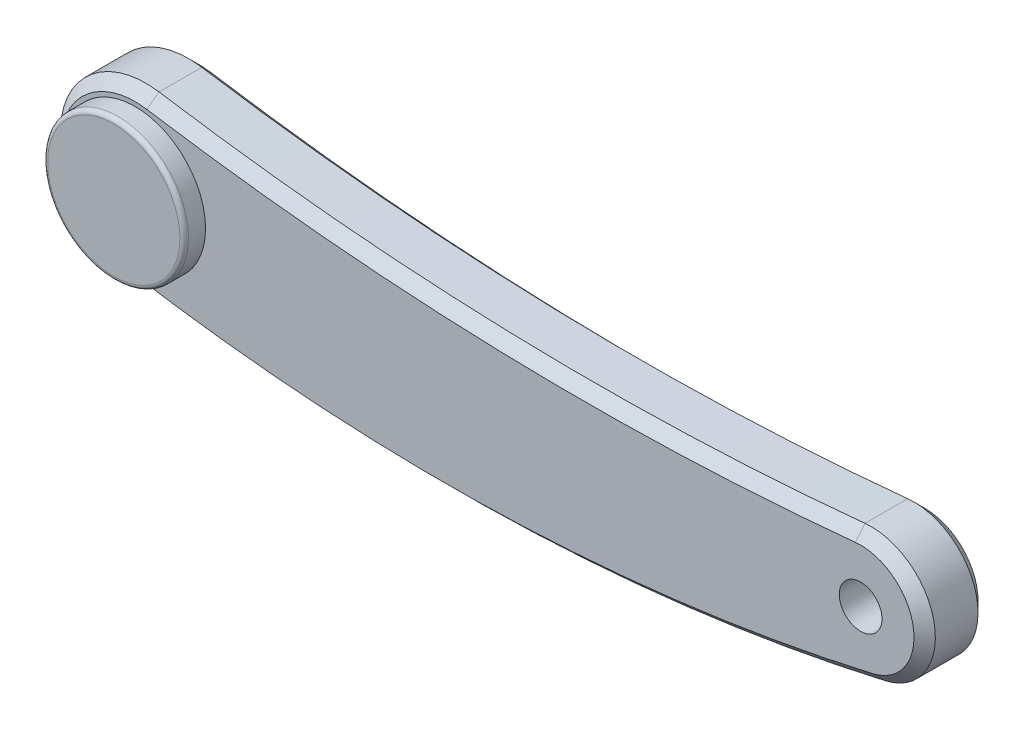
ISO-10303-21;
HEADER;
FILE_DESCRIPTION(('STEP AP214'),'2;1');
FILE_NAME('part.step','',(''),(''),'','','');
FILE_SCHEMA(('AUTOMOTIVE_DESIGN { 1 0 10303 214 1 1 1 1 }'));
ENDSEC;
DATA;
#1=APPLICATION_CONTEXT('core data for automotive mechanical design processes');
#2=APPLICATION_PROTOCOL_DEFINITION('international standard','automotive_design',2000,#1);
#3=PRODUCT_CONTEXT('',#1,'mechanical');
#4=PRODUCT('Part','Part','',(#3));
#5=PRODUCT_RELATED_PRODUCT_CATEGORY('part','',(#4));
#6=PRODUCT_DEFINITION_FORMATION('','',#4);
#7=PRODUCT_DEFINITION_CONTEXT('part definition',#1,'design');
#8=PRODUCT_DEFINITION('design','',#6,#7);
#9=PRODUCT_DEFINITION_SHAPE('','',#8);
#10=(LENGTH_UNIT() NAMED_UNIT(*) SI_UNIT(.MILLI.,.METRE.));
#11=(NAMED_UNIT(*) PLANE_ANGLE_UNIT() SI_UNIT($,.RADIAN.));
#12=(NAMED_UNIT(*) SI_UNIT($,.STERADIAN.) SOLID_ANGLE_UNIT());
#13=UNCERTAINTY_MEASURE_WITH_UNIT(LENGTH_MEASURE(1.E-05),#10,'distance_accuracy_value','');
#14=(GEOMETRIC_REPRESENTATION_CONTEXT(3) GLOBAL_UNCERTAINTY_ASSIGNED_CONTEXT((#13)) GLOBAL_UNIT_ASSIGNED_CONTEXT((#10,
#11,#12)) REPRESENTATION_CONTEXT('',''));
#15=CARTESIAN_POINT('',(0.,0.,0.));
#16=DIRECTION('',(0.,0.,1.));
#17=DIRECTION('',(1.,0.,0.));
#18=AXIS2_PLACEMENT_3D('',#15,#16,#17);
#19=CARTESIAN_POINT('',(-12.7205882352943,423.881689431082,7.5));
#20=DIRECTION('',(0.,0.,-1.));
#21=DIRECTION('',(-1.,0.,0.));
#22=AXIS2_PLACEMENT_3D('',#19,#20,#21);
#23=CYLINDRICAL_SURFACE('',#22,450.);
#24=DIRECTION('',(0.,0.,-1.));
#25=VECTOR('',#24,1.);
#26=CARTESIAN_POINT('',(-88.3618331053352,-19.7154274153992,7.5));
#27=LINE('',#26,#25);
#28=CARTESIAN_POINT('',(-88.3618331053352,-19.7154274153992,5.));
#29=VERTEX_POINT('',#28);
#30=CARTESIAN_POINT('',(-88.3618331053352,-19.7154274153992,-4.99999999999989));
#31=VERTEX_POINT('',#30);
#32=EDGE_CURVE('E365',#29,#31,#27,.T.);
#33=ORIENTED_EDGE('',*,*,#32,.T.);
#34=CARTESIAN_POINT('',(-12.7205882352943,423.881689431082,-4.99999999999989));
#35=DIRECTION('',(0.,0.,1.));
#36=DIRECTION('',(1.,0.,0.));
#37=AXIS2_PLACEMENT_3D('',#34,#35,#36);
#38=CIRCLE('',#37,450.);
#39=CARTESIAN_POINT('',(88.3696754563895,-14.6166099803821,-4.99999999999989));
#40=VERTEX_POINT('',#39);
#41=EDGE_CURVE('E398',#31,#40,#38,.T.);
#42=ORIENTED_EDGE('',*,*,#41,.T.);
#43=DIRECTION('',(0.,0.,-1.));
#44=VECTOR('',#43,1.);
#45=CARTESIAN_POINT('',(88.3696754563895,-14.6166099803821,7.5));
#46=LINE('',#45,#44);
#47=CARTESIAN_POINT('',(88.3696754563895,-14.6166099803821,5.));
#48=VERTEX_POINT('',#47);
#49=EDGE_CURVE('E139',#48,#40,#46,.T.);
#50=ORIENTED_EDGE('',*,*,#49,.F.);
#51=CARTESIAN_POINT('',(-12.7205882352943,423.881689431082,5.));
#52=DIRECTION('',(0.,0.,1.));
#53=DIRECTION('',(1.,0.,0.));
#54=AXIS2_PLACEMENT_3D('',#51,#52,#53);
#55=CIRCLE('',#54,450.);
#56=EDGE_CURVE('E395',#48,#29,#55,.F.);
#57=ORIENTED_EDGE('',*,*,#56,.T.);
#58=EDGE_LOOP('',(#33,#42,#50,#57));
#59=FACE_BOUND('',#58,.T.);
#60=ADVANCED_FACE('F49',(#59),#23,.T.);
#61=CARTESIAN_POINT('',(85.,0.,7.5));
#62=DIRECTION('',(0.,0.,-1.));
#63=DIRECTION('',(-1.,0.,0.));
#64=AXIS2_PLACEMENT_3D('',#61,#62,#63);
#65=CYLINDRICAL_SURFACE('',#64,15.);
#66=ORIENTED_EDGE('',*,*,#49,.T.);
#67=CARTESIAN_POINT('',(85.,0.,-4.99999999999989));
#68=DIRECTION('',(0.,0.,1.));
#69=DIRECTION('',(1.,0.,0.));
#70=AXIS2_PLACEMENT_3D('',#67,#68,#69);
#71=CIRCLE('',#70,15.);
#72=CARTESIAN_POINT('',(83.5255417956656,14.9273565310028,-4.99999999999989));
#73=VERTEX_POINT('',#72);
#74=EDGE_CURVE('E137',#40,#73,#71,.T.);
#75=ORIENTED_EDGE('',*,*,#74,.T.);
#76=DIRECTION('',(0.,0.,-1.));
#77=VECTOR('',#76,1.);
#78=CARTESIAN_POINT('',(83.5255417956656,14.9273565310028,7.5));
#79=LINE('',#78,#77);
#80=CARTESIAN_POINT('',(83.5255417956656,14.9273565310028,5.));
#81=VERTEX_POINT('',#80);
#82=EDGE_CURVE('E119',#81,#73,#79,.T.);
#83=ORIENTED_EDGE('',*,*,#82,.F.);
#84=CARTESIAN_POINT('',(85.,0.,5.));
#85=DIRECTION('',(0.,0.,1.));
#86=DIRECTION('',(1.,0.,0.));
#87=AXIS2_PLACEMENT_3D('',#84,#85,#86);
#88=CIRCLE('',#87,15.);
#89=EDGE_CURVE('E134',#81,#48,#88,.F.);
#90=ORIENTED_EDGE('',*,*,#89,.T.);
#91=EDGE_LOOP('',(#66,#75,#83,#90));
#92=FACE_BOUND('',#91,.T.);
#93=ADVANCED_FACE('F133',(#92),#65,.T.);
#94=CARTESIAN_POINT('',(19.6323529411765,661.779472874456,7.5));
#95=DIRECTION('',(0.,0.,-1.));
#96=DIRECTION('',(-1.,0.,0.));
#97=AXIS2_PLACEMENT_3D('',#94,#95,#96);
#98=CYLINDRICAL_SURFACE('',#97,650.);
#99=ORIENTED_EDGE('',*,*,#82,.T.);
#100=CARTESIAN_POINT('',(19.6323529411765,661.779472874456,-4.99999999999989));
#101=DIRECTION('',(0.,0.,1.));
#102=DIRECTION('',(1.,0.,0.));
#103=AXIS2_PLACEMENT_3D('',#100,#101,#102);
#104=CIRCLE('',#103,650.);
#105=CARTESIAN_POINT('',(-81.8766461808604,19.7546111305808,-4.99999999999989));
#106=VERTEX_POINT('',#105);
#107=EDGE_CURVE('E126',#73,#106,#104,.F.);
#108=ORIENTED_EDGE('',*,*,#107,.T.);
#109=DIRECTION('',(0.,0.,-1.));
#110=VECTOR('',#109,1.);
#111=CARTESIAN_POINT('',(-81.8766461808604,19.7546111305808,7.5));
#112=LINE('',#111,#110);
#113=CARTESIAN_POINT('',(-81.8766461808604,19.7546111305808,5.));
#114=VERTEX_POINT('',#113);
#115=EDGE_CURVE('E121',#114,#106,#112,.T.);
#116=ORIENTED_EDGE('',*,*,#115,.F.);
#117=CARTESIAN_POINT('',(19.6323529411765,661.779472874456,5.));
#118=DIRECTION('',(0.,0.,1.));
#119=DIRECTION('',(1.,0.,0.));
#120=AXIS2_PLACEMENT_3D('',#117,#118,#119);
#121=CIRCLE('',#120,650.);
#122=EDGE_CURVE('E116',#114,#81,#121,.T.);
#123=ORIENTED_EDGE('',*,*,#122,.T.);
#124=EDGE_LOOP('',(#99,#108,#116,#123));
#125=FACE_BOUND('',#124,.T.);
#126=ADVANCED_FACE('F118',(#125),#98,.F.);
#127=CARTESIAN_POINT('',(-85.,0.,7.5));
#128=DIRECTION('',(0.,0.,-1.));
#129=DIRECTION('',(-1.,0.,0.));
#130=AXIS2_PLACEMENT_3D('',#127,#128,#129);
#131=CYLINDRICAL_SURFACE('',#130,20.);
#132=ORIENTED_EDGE('',*,*,#115,.T.);
#133=CARTESIAN_POINT('',(-85.,0.,-4.99999999999989));
#134=DIRECTION('',(0.,0.,1.));
#135=DIRECTION('',(1.,0.,0.));
#136=AXIS2_PLACEMENT_3D('',#133,#134,#135);
#137=CIRCLE('',#136,20.);
#138=EDGE_CURVE('E392',#106,#31,#137,.T.);
#139=ORIENTED_EDGE('',*,*,#138,.T.);
#140=ORIENTED_EDGE('',*,*,#32,.F.);
#141=CARTESIAN_POINT('',(-85.,0.,5.));
#142=DIRECTION('',(0.,0.,1.));
#143=DIRECTION('',(1.,0.,0.));
#144=AXIS2_PLACEMENT_3D('',#141,#142,#143);
#145=CIRCLE('',#144,20.);
#146=EDGE_CURVE('E389',#29,#114,#145,.F.);
#147=ORIENTED_EDGE('',*,*,#146,.T.);
#148=EDGE_LOOP('',(#132,#139,#140,#147));
#149=FACE_BOUND('',#148,.T.);
#150=ADVANCED_FACE('F291',(#149),#131,.T.);
#151=CARTESIAN_POINT('',(0.,0.,7.5));
#152=DIRECTION('',(0.,0.,1.));
#153=DIRECTION('',(1.,0.,0.));
#154=AXIS2_PLACEMENT_3D('',#151,#152,#153);
#155=PLANE('',#154);
#156=CARTESIAN_POINT('',(85.,0.,7.5));
#157=DIRECTION('',(0.,0.,1.));
#158=DIRECTION('',(1.,0.,0.));
#159=AXIS2_PLACEMENT_3D('',#156,#157,#158);
#160=CIRCLE('',#159,5.);
#161=CARTESIAN_POINT('',(90.,0.,7.5));
#162=VERTEX_POINT('',#161);
#163=EDGE_CURVE('E350',#162,#162,#160,.T.);
#164=ORIENTED_EDGE('',*,*,#163,.F.);
#165=EDGE_LOOP('',(#164));
#166=FACE_BOUND('',#165,.T.);
#167=CARTESIAN_POINT('',(-85.,0.,7.5));
#168=DIRECTION('',(0.,0.,1.));
#169=DIRECTION('',(1.,0.,0.));
#170=AXIS2_PLACEMENT_3D('',#167,#168,#169);
#171=CIRCLE('',#170,16.5);
#172=CARTESIAN_POINT('',(-68.5,0.,7.5));
#173=VERTEX_POINT('',#172);
#174=EDGE_CURVE('E359',#173,#173,#171,.T.);
#175=ORIENTED_EDGE('',*,*,#174,.F.);
#176=EDGE_LOOP('',(#175));
#177=FACE_BOUND('',#176,.T.);
#178=CARTESIAN_POINT('',(19.6323529411765,661.779472874456,7.5));
#179=DIRECTION('',(0.,0.,1.));
#180=DIRECTION('',(1.,0.,0.));
#181=AXIS2_PLACEMENT_3D('',#178,#179,#180);
#182=CIRCLE('',#181,652.5);
#183=CARTESIAN_POINT('',(83.7712848297214,12.4394637758357,7.5));
#184=VERTEX_POINT('',#183);
#185=CARTESIAN_POINT('',(-82.2670654082529,17.2852847392581,7.5));
#186=VERTEX_POINT('',#185);
#187=EDGE_CURVE('E65',#184,#186,#182,.F.);
#188=ORIENTED_EDGE('',*,*,#187,.T.);
#189=CARTESIAN_POINT('',(-85.,0.,7.5));
#190=DIRECTION('',(0.,0.,1.));
#191=DIRECTION('',(1.,0.,0.));
#192=AXIS2_PLACEMENT_3D('',#189,#190,#191);
#193=CIRCLE('',#192,17.5);
#194=CARTESIAN_POINT('',(-87.9416039671683,-17.2509989884744,7.5));
#195=VERTEX_POINT('',#194);
#196=EDGE_CURVE('E165',#186,#195,#193,.T.);
#197=ORIENTED_EDGE('',*,*,#196,.T.);
#198=CARTESIAN_POINT('',(-12.7205882352943,423.881689431082,7.5));
#199=DIRECTION('',(0.,0.,1.));
#200=DIRECTION('',(1.,0.,0.));
#201=AXIS2_PLACEMENT_3D('',#198,#199,#200);
#202=CIRCLE('',#201,447.5);
#203=CARTESIAN_POINT('',(87.8080628803246,-12.1805083169852,7.5));
#204=VERTEX_POINT('',#203);
#205=EDGE_CURVE('E401',#195,#204,#202,.T.);
#206=ORIENTED_EDGE('',*,*,#205,.T.);
#207=CARTESIAN_POINT('',(85.,0.,7.5));
#208=DIRECTION('',(0.,0.,1.));
#209=DIRECTION('',(1.,0.,0.));
#210=AXIS2_PLACEMENT_3D('',#207,#208,#209);
#211=CIRCLE('',#210,12.5);
#212=EDGE_CURVE('E70',#204,#184,#211,.T.);
#213=ORIENTED_EDGE('',*,*,#212,.T.);
#214=EDGE_LOOP('',(#188,#197,#206,#213));
#215=FACE_BOUND('',#214,.T.);
#216=ADVANCED_FACE('F286',(#166,#177,#215),#155,.T.);
#217=CARTESIAN_POINT('',(0.,0.,-7.5));
#218=DIRECTION('',(0.,0.,1.));
#219=DIRECTION('',(1.,0.,0.));
#220=AXIS2_PLACEMENT_3D('',#217,#218,#219);
#221=PLANE('',#220);
#222=CARTESIAN_POINT('',(-85.,0.,-7.5));
#223=DIRECTION('',(0.,0.,1.));
#224=DIRECTION('',(1.,0.,0.));
#225=AXIS2_PLACEMENT_3D('',#222,#223,#224);
#226=CIRCLE('',#225,5.);
#227=CARTESIAN_POINT('',(-80.,0.,-7.5));
#228=VERTEX_POINT('',#227);
#229=EDGE_CURVE('E12',#228,#228,#226,.F.);
#230=ORIENTED_EDGE('',*,*,#229,.F.);
#231=EDGE_LOOP('',(#230));
#232=FACE_BOUND('',#231,.T.);
#233=CARTESIAN_POINT('',(19.6323529411765,661.779472874456,-7.5));
#234=DIRECTION('',(0.,0.,1.));
#235=DIRECTION('',(1.,0.,0.));
#236=AXIS2_PLACEMENT_3D('',#233,#234,#235);
#237=CIRCLE('',#236,652.5);
#238=CARTESIAN_POINT('',(-82.2670654082529,17.2852847392581,-7.5));
#239=VERTEX_POINT('',#238);
#240=CARTESIAN_POINT('',(83.7712848297214,12.4394637758353,-7.5));
#241=VERTEX_POINT('',#240);
#242=EDGE_CURVE('E381',#239,#241,#237,.T.);
#243=ORIENTED_EDGE('',*,*,#242,.T.);
#244=CARTESIAN_POINT('',(85.,0.,-7.5));
#245=DIRECTION('',(0.,0.,1.));
#246=DIRECTION('',(1.,0.,0.));
#247=AXIS2_PLACEMENT_3D('',#244,#245,#246);
#248=CIRCLE('',#247,12.4999999999999);
#249=CARTESIAN_POINT('',(87.8080628803246,-12.1805083169851,-7.5));
#250=VERTEX_POINT('',#249);
#251=EDGE_CURVE('E127',#241,#250,#248,.F.);
#252=ORIENTED_EDGE('',*,*,#251,.T.);
#253=CARTESIAN_POINT('',(-12.7205882352943,423.881689431082,-7.5));
#254=DIRECTION('',(0.,0.,1.));
#255=DIRECTION('',(1.,0.,0.));
#256=AXIS2_PLACEMENT_3D('',#253,#254,#255);
#257=CIRCLE('',#256,447.5);
#258=CARTESIAN_POINT('',(-87.9416039671683,-17.2509989884743,-7.5));
#259=VERTEX_POINT('',#258);
#260=EDGE_CURVE('E375',#250,#259,#257,.F.);
#261=ORIENTED_EDGE('',*,*,#260,.T.);
#262=CARTESIAN_POINT('',(-85.,0.,-7.5));
#263=DIRECTION('',(0.,0.,1.));
#264=DIRECTION('',(1.,0.,0.));
#265=AXIS2_PLACEMENT_3D('',#262,#263,#264);
#266=CIRCLE('',#265,17.4999999999999);
#267=EDGE_CURVE('E378',#259,#239,#266,.F.);
#268=ORIENTED_EDGE('',*,*,#267,.T.);
#269=EDGE_LOOP('',(#243,#252,#261,#268));
#270=FACE_BOUND('',#269,.T.);
#271=ADVANCED_FACE('F225',(#232,#270),#221,.F.);
#272=CARTESIAN_POINT('',(-85.,0.,-4.99999999999989));
#273=DIRECTION('',(0.,0.,1.));
#274=DIRECTION('',(1.,0.,0.));
#275=AXIS2_PLACEMENT_3D('',#272,#273,#274);
#276=CONICAL_SURFACE('',#275,20.,0.785398163397449);
#277=DIRECTION('',(0.110427233277926,0.698430974506847,0.707106781186547));
#278=VECTOR('',#277,1.);
#279=CARTESIAN_POINT('',(-82.2670654082529,17.2852847392581,-7.5));
#280=LINE('',#279,#278);
#281=EDGE_CURVE('E412',#239,#106,#280,.T.);
#282=ORIENTED_EDGE('',*,*,#281,.F.);
#283=ORIENTED_EDGE('',*,*,#267,.F.);
#284=DIRECTION('',(0.118858749299997,0.697045620970996,-0.707106781186547));
#285=VECTOR('',#284,1.);
#286=CARTESIAN_POINT('',(-88.3618331053352,-19.7154274153992,-4.99999999999989));
#287=LINE('',#286,#285);
#288=EDGE_CURVE('E368',#31,#259,#287,.T.);
#289=ORIENTED_EDGE('',*,*,#288,.F.);
#290=ORIENTED_EDGE('',*,*,#138,.F.);
#291=EDGE_LOOP('',(#282,#283,#289,#290));
#292=FACE_BOUND('',#291,.T.);
#293=ADVANCED_FACE('F219',(#292),#276,.T.);
#294=CARTESIAN_POINT('',(-12.7205882352943,423.881689431082,-4.99999999999989));
#295=DIRECTION('',(0.,0.,1.));
#296=DIRECTION('',(1.,0.,0.));
#297=AXIS2_PLACEMENT_3D('',#294,#295,#296);
#298=CONICAL_SURFACE('',#297,450.,0.785398163397448);
#299=ORIENTED_EDGE('',*,*,#288,.T.);
#300=ORIENTED_EDGE('',*,*,#260,.F.);
#301=DIRECTION('',(-0.158848024374059,0.689033602339154,-0.707106781186539));
#302=VECTOR('',#301,1.);
#303=CARTESIAN_POINT('',(88.3696754563895,-14.6166099803823,-4.99999999999989));
#304=LINE('',#303,#302);
#305=EDGE_CURVE('E156',#40,#250,#304,.T.);
#306=ORIENTED_EDGE('',*,*,#305,.F.);
#307=ORIENTED_EDGE('',*,*,#41,.F.);
#308=EDGE_LOOP('',(#299,#300,#306,#307));
#309=FACE_BOUND('',#308,.T.);
#310=ADVANCED_FACE('F212',(#309),#298,.T.);
#311=CARTESIAN_POINT('',(19.6323529411765,661.779472874456,-7.5));
#312=DIRECTION('',(0.,0.,-1.));
#313=DIRECTION('',(-1.,0.,0.));
#314=AXIS2_PLACEMENT_3D('',#311,#312,#313);
#315=CONICAL_SURFACE('',#314,652.5,0.785398163397459);
#316=ORIENTED_EDGE('',*,*,#281,.T.);
#317=ORIENTED_EDGE('',*,*,#107,.F.);
#318=DIRECTION('',(-0.0695066263240666,0.70368233521744,0.707106781186532));
#319=VECTOR('',#318,1.);
#320=CARTESIAN_POINT('',(83.7712848297214,12.4394637758353,-7.5));
#321=LINE('',#320,#319);
#322=EDGE_CURVE('E152',#241,#73,#321,.T.);
#323=ORIENTED_EDGE('',*,*,#322,.F.);
#324=ORIENTED_EDGE('',*,*,#242,.F.);
#325=EDGE_LOOP('',(#316,#317,#323,#324));
#326=FACE_BOUND('',#325,.T.);
#327=ADVANCED_FACE('F205',(#326),#315,.F.);
#328=CARTESIAN_POINT('',(85.,0.,-4.99999999999989));
#329=DIRECTION('',(0.,0.,1.));
#330=DIRECTION('',(1.,0.,0.));
#331=AXIS2_PLACEMENT_3D('',#328,#329,#330);
#332=CONICAL_SURFACE('',#331,15.,0.785398163397449);
#333=ORIENTED_EDGE('',*,*,#305,.T.);
#334=ORIENTED_EDGE('',*,*,#251,.F.);
#335=ORIENTED_EDGE('',*,*,#322,.T.);
#336=ORIENTED_EDGE('',*,*,#74,.F.);
#337=EDGE_LOOP('',(#333,#334,#335,#336));
#338=FACE_BOUND('',#337,.T.);
#339=ADVANCED_FACE('F198',(#338),#332,.T.);
#340=CARTESIAN_POINT('',(85.,0.,7.5));
#341=DIRECTION('',(0.,0.,-1.));
#342=DIRECTION('',(-1.,0.,0.));
#343=AXIS2_PLACEMENT_3D('',#340,#341,#342);
#344=CONICAL_SURFACE('',#343,12.5,0.785398163397443);
#345=DIRECTION('',(-0.158848024374057,0.689033602339141,0.707106781186551));
#346=VECTOR('',#345,1.);
#347=CARTESIAN_POINT('',(88.3696754563895,-14.6166099803821,5.));
#348=LINE('',#347,#346);
#349=EDGE_CURVE('E146',#48,#204,#348,.T.);
#350=ORIENTED_EDGE('',*,*,#349,.F.);
#351=ORIENTED_EDGE('',*,*,#89,.F.);
#352=DIRECTION('',(-0.0695066263240637,0.703682335217421,-0.707106781186551));
#353=VECTOR('',#352,1.);
#354=CARTESIAN_POINT('',(83.7712848297214,12.4394637758357,7.5));
#355=LINE('',#354,#353);
#356=EDGE_CURVE('E144',#184,#81,#355,.T.);
#357=ORIENTED_EDGE('',*,*,#356,.F.);
#358=ORIENTED_EDGE('',*,*,#212,.F.);
#359=EDGE_LOOP('',(#350,#351,#357,#358));
#360=FACE_BOUND('',#359,.T.);
#361=ADVANCED_FACE('F143',(#360),#344,.T.);
#362=CARTESIAN_POINT('',(19.6323529411765,661.779472874456,5.));
#363=DIRECTION('',(0.,0.,1.));
#364=DIRECTION('',(1.,0.,0.));
#365=AXIS2_PLACEMENT_3D('',#362,#363,#364);
#366=CONICAL_SURFACE('',#365,650.,0.785398163397437);
#367=ORIENTED_EDGE('',*,*,#356,.T.);
#368=ORIENTED_EDGE('',*,*,#122,.F.);
#369=DIRECTION('',(0.110427233277924,0.698430974506843,-0.707106781186551));
#370=VECTOR('',#369,1.);
#371=CARTESIAN_POINT('',(-82.2670654082529,17.2852847392581,7.5));
#372=LINE('',#371,#370);
#373=EDGE_CURVE('E158',#186,#114,#372,.T.);
#374=ORIENTED_EDGE('',*,*,#373,.F.);
#375=ORIENTED_EDGE('',*,*,#187,.F.);
#376=EDGE_LOOP('',(#367,#368,#374,#375));
#377=FACE_BOUND('',#376,.T.);
#378=ADVANCED_FACE('F150',(#377),#366,.F.);
#379=CARTESIAN_POINT('',(-12.7205882352943,423.881689431082,7.5));
#380=DIRECTION('',(0.,0.,-1.));
#381=DIRECTION('',(-1.,0.,0.));
#382=AXIS2_PLACEMENT_3D('',#379,#380,#381);
#383=CONICAL_SURFACE('',#382,447.5,0.785398163397448);
#384=ORIENTED_EDGE('',*,*,#349,.T.);
#385=ORIENTED_EDGE('',*,*,#205,.F.);
#386=DIRECTION('',(0.118858749299995,0.697045620970992,0.707106781186551));
#387=VECTOR('',#386,1.);
#388=CARTESIAN_POINT('',(-88.3618331053352,-19.7154274153993,5.));
#389=LINE('',#388,#387);
#390=EDGE_CURVE('E364',#29,#195,#389,.T.);
#391=ORIENTED_EDGE('',*,*,#390,.F.);
#392=ORIENTED_EDGE('',*,*,#56,.F.);
#393=EDGE_LOOP('',(#384,#385,#391,#392));
#394=FACE_BOUND('',#393,.T.);
#395=ADVANCED_FACE('F233',(#394),#383,.T.);
#396=CARTESIAN_POINT('',(-85.,0.,7.5));
#397=DIRECTION('',(0.,0.,-1.));
#398=DIRECTION('',(-1.,0.,0.));
#399=AXIS2_PLACEMENT_3D('',#396,#397,#398);
#400=CONICAL_SURFACE('',#399,17.5,0.785398163397443);
#401=ORIENTED_EDGE('',*,*,#373,.T.);
#402=ORIENTED_EDGE('',*,*,#146,.F.);
#403=ORIENTED_EDGE('',*,*,#390,.T.);
#404=ORIENTED_EDGE('',*,*,#196,.F.);
#405=EDGE_LOOP('',(#401,#402,#403,#404));
#406=FACE_BOUND('',#405,.T.);
#407=ADVANCED_FACE('F184',(#406),#400,.T.);
#408=CARTESIAN_POINT('',(-85.,0.,12.5));
#409=DIRECTION('',(0.,0.,-1.));
#410=DIRECTION('',(-1.,0.,0.));
#411=AXIS2_PLACEMENT_3D('',#408,#409,#410);
#412=CYLINDRICAL_SURFACE('',#411,16.5);
#413=CARTESIAN_POINT('',(-85.,0.,11.5));
#414=DIRECTION('',(0.,0.,1.));
#415=DIRECTION('',(1.,0.,0.));
#416=AXIS2_PLACEMENT_3D('',#413,#414,#415);
#417=CIRCLE('',#416,16.5);
#418=CARTESIAN_POINT('',(-68.5,0.,11.5));
#419=VERTEX_POINT('',#418);
#420=EDGE_CURVE('E58',#419,#419,#417,.F.);
#421=ORIENTED_EDGE('',*,*,#420,.T.);
#422=EDGE_LOOP('',(#421));
#423=FACE_BOUND('',#422,.T.);
#424=ORIENTED_EDGE('',*,*,#174,.T.);
#425=EDGE_LOOP('',(#424));
#426=FACE_BOUND('',#425,.T.);
#427=ADVANCED_FACE('F170',(#423,#426),#412,.T.);
#428=CARTESIAN_POINT('',(-85.,0.,12.5));
#429=DIRECTION('',(0.,0.,1.));
#430=DIRECTION('',(1.,0.,0.));
#431=AXIS2_PLACEMENT_3D('',#428,#429,#430);
#432=PLANE('',#431);
#433=CARTESIAN_POINT('',(-85.,0.,12.5));
#434=DIRECTION('',(0.,0.,1.));
#435=DIRECTION('',(1.,0.,0.));
#436=AXIS2_PLACEMENT_3D('',#433,#434,#435);
#437=CIRCLE('',#436,15.5);
#438=CARTESIAN_POINT('',(-69.5,0.,12.5));
#439=VERTEX_POINT('',#438);
#440=EDGE_CURVE('E162',#439,#439,#437,.T.);
#441=ORIENTED_EDGE('',*,*,#440,.T.);
#442=EDGE_LOOP('',(#441));
#443=FACE_BOUND('',#442,.T.);
#444=ADVANCED_FACE('F176',(#443),#432,.T.);
#445=CARTESIAN_POINT('',(-85.,0.,11.5));
#446=DIRECTION('',(0.,0.,1.));
#447=DIRECTION('',(1.,0.,0.));
#448=AXIS2_PLACEMENT_3D('',#445,#446,#447);
#449=TOROIDAL_SURFACE('',#448,15.5,1.);
#450=ORIENTED_EDGE('',*,*,#420,.F.);
#451=EDGE_LOOP('',(#450));
#452=FACE_BOUND('',#451,.T.);
#453=ORIENTED_EDGE('',*,*,#440,.F.);
#454=EDGE_LOOP('',(#453));
#455=FACE_BOUND('',#454,.T.);
#456=ADVANCED_FACE('F51',(#452,#455),#449,.T.);
#457=CARTESIAN_POINT('',(85.,0.,-2.5));
#458=DIRECTION('',(0.,0.,1.));
#459=DIRECTION('',(1.,0.,0.));
#460=AXIS2_PLACEMENT_3D('',#457,#458,#459);
#461=CYLINDRICAL_SURFACE('',#460,5.);
#462=CARTESIAN_POINT('',(85.,0.,-2.5));
#463=DIRECTION('',(0.,0.,1.));
#464=DIRECTION('',(1.,0.,0.));
#465=AXIS2_PLACEMENT_3D('',#462,#463,#464);
#466=CIRCLE('',#465,5.);
#467=CARTESIAN_POINT('',(90.,0.,-2.5));
#468=VERTEX_POINT('',#467);
#469=EDGE_CURVE('E354',#468,#468,#466,.T.);
#470=ORIENTED_EDGE('',*,*,#469,.F.);
#471=EDGE_LOOP('',(#470));
#472=FACE_BOUND('',#471,.T.);
#473=ORIENTED_EDGE('',*,*,#163,.T.);
#474=EDGE_LOOP('',(#473));
#475=FACE_BOUND('',#474,.T.);
#476=ADVANCED_FACE('F175',(#472,#475),#461,.F.);
#477=CARTESIAN_POINT('',(85.,0.,-2.5));
#478=DIRECTION('',(0.,0.,1.));
#479=DIRECTION('',(1.,0.,0.));
#480=AXIS2_PLACEMENT_3D('',#477,#478,#479);
#481=PLANE('',#480);
#482=ORIENTED_EDGE('',*,*,#469,.T.);
#483=EDGE_LOOP('',(#482));
#484=FACE_BOUND('',#483,.T.);
#485=ADVANCED_FACE('F303',(#484),#481,.T.);
#486=CARTESIAN_POINT('',(-85.,0.,-17.5));
#487=DIRECTION('',(0.,0.,1.));
#488=DIRECTION('',(1.,0.,0.));
#489=AXIS2_PLACEMENT_3D('',#486,#487,#488);
#490=CYLINDRICAL_SURFACE('',#489,5.);
#491=CARTESIAN_POINT('',(-85.,0.,-17.5));
#492=DIRECTION('',(0.,0.,-1.));
#493=DIRECTION('',(-1.,0.,0.));
#494=AXIS2_PLACEMENT_3D('',#491,#492,#493);
#495=CIRCLE('',#494,5.);
#496=CARTESIAN_POINT('',(-90.,0.,-17.5));
#497=VERTEX_POINT('',#496);
#498=EDGE_CURVE('E348',#497,#497,#495,.T.);
#499=ORIENTED_EDGE('',*,*,#498,.F.);
#500=EDGE_LOOP('',(#499));
#501=FACE_BOUND('',#500,.T.);
#502=ORIENTED_EDGE('',*,*,#229,.T.);
#503=EDGE_LOOP('',(#502));
#504=FACE_BOUND('',#503,.T.);
#505=ADVANCED_FACE('F312',(#501,#504),#490,.T.);
#506=CARTESIAN_POINT('',(-85.,0.,-17.5));
#507=DIRECTION('',(0.,0.,-1.));
#508=DIRECTION('',(-1.,0.,0.));
#509=AXIS2_PLACEMENT_3D('',#506,#507,#508);
#510=PLANE('',#509);
#511=ORIENTED_EDGE('',*,*,#498,.T.);
#512=EDGE_LOOP('',(#511));
#513=FACE_BOUND('',#512,.T.);
#514=ADVANCED_FACE('F332',(#513),#510,.T.);
#515=CLOSED_SHELL('',(#60,#93,#126,#150,#216,#271,#293,#310,#327,#339,#361,#378,#395,#407,#427,
#444,#456,#476,#485,#505,#514));
#516=MANIFOLD_SOLID_BREP('B2',#515);
#517=ADVANCED_BREP_SHAPE_REPRESENTATION('',(#18,#516),#14);
#518=SHAPE_DEFINITION_REPRESENTATION(#9,#517);
ENDSEC;
END-ISO-10303-21;
